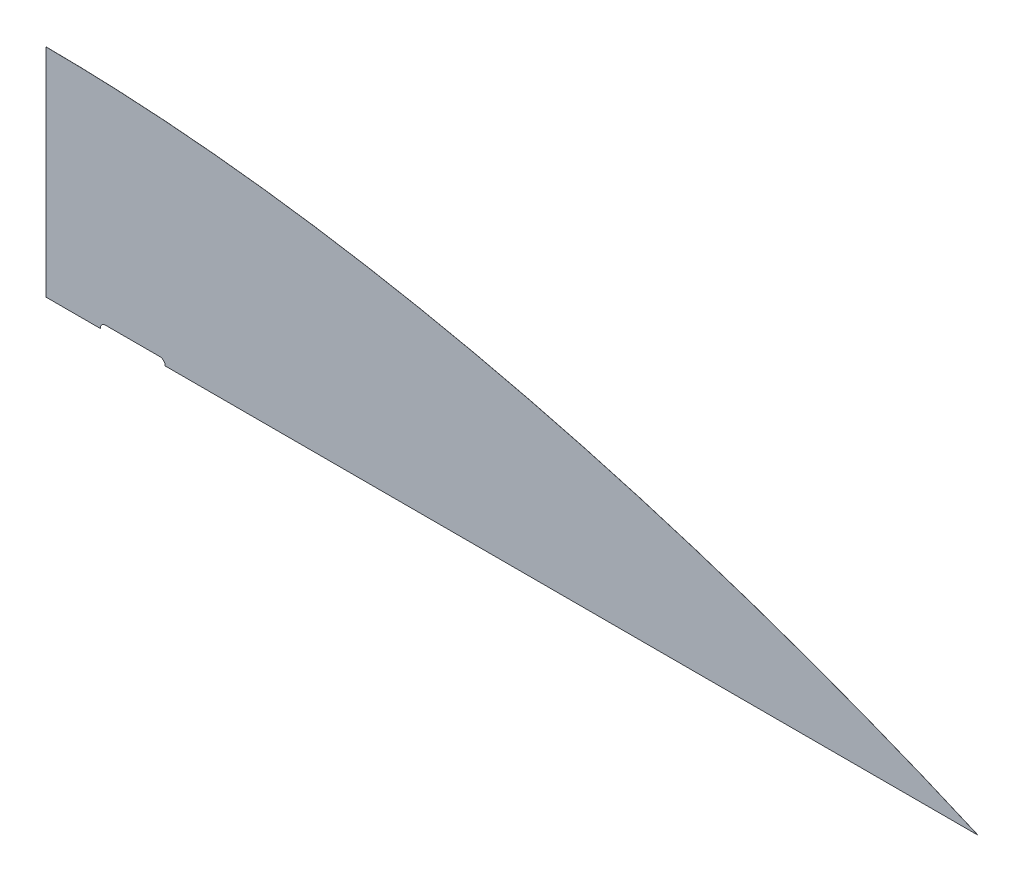
ISO-10303-21;
HEADER;
FILE_DESCRIPTION(('STEP AP214'),'2;1');
FILE_NAME('part.step','',(''),(''),'','','');
FILE_SCHEMA(('AUTOMOTIVE_DESIGN { 1 0 10303 214 1 1 1 1 }'));
ENDSEC;
DATA;
#1=APPLICATION_CONTEXT('core data for automotive mechanical design processes');
#2=APPLICATION_PROTOCOL_DEFINITION('international standard','automotive_design',2000,#1);
#3=PRODUCT_CONTEXT('',#1,'mechanical');
#4=PRODUCT('Part','Part','',(#3));
#5=PRODUCT_RELATED_PRODUCT_CATEGORY('part','',(#4));
#6=PRODUCT_DEFINITION_FORMATION('','',#4);
#7=PRODUCT_DEFINITION_CONTEXT('part definition',#1,'design');
#8=PRODUCT_DEFINITION('design','',#6,#7);
#9=PRODUCT_DEFINITION_SHAPE('','',#8);
#10=(LENGTH_UNIT() NAMED_UNIT(*) SI_UNIT(.MILLI.,.METRE.));
#11=(NAMED_UNIT(*) PLANE_ANGLE_UNIT() SI_UNIT($,.RADIAN.));
#12=(NAMED_UNIT(*) SI_UNIT($,.STERADIAN.) SOLID_ANGLE_UNIT());
#13=UNCERTAINTY_MEASURE_WITH_UNIT(LENGTH_MEASURE(1.E-05),#10,'distance_accuracy_value','');
#14=(GEOMETRIC_REPRESENTATION_CONTEXT(3) GLOBAL_UNCERTAINTY_ASSIGNED_CONTEXT((#13)) GLOBAL_UNIT_ASSIGNED_CONTEXT((#10,
#11,#12)) REPRESENTATION_CONTEXT('',''));
#15=CARTESIAN_POINT('',(0.,0.,0.));
#16=DIRECTION('',(0.,0.,1.));
#17=DIRECTION('',(1.,0.,0.));
#18=AXIS2_PLACEMENT_3D('',#15,#16,#17);
#19=CARTESIAN_POINT('',(0.,0.,0.126999999999999));
#20=DIRECTION('',(0.,1.,0.));
#21=DIRECTION('',(0.,0.,1.));
#22=AXIS2_PLACEMENT_3D('',#19,#20,#21);
#23=PLANE('',#22);
#24=DIRECTION('',(0.,0.,1.));
#25=VECTOR('',#24,1.);
#26=CARTESIAN_POINT('',(63.5,0.,0.));
#27=LINE('',#26,#25);
#28=CARTESIAN_POINT('',(63.4999999999999,0.,0.));
#29=VERTEX_POINT('',#28);
#30=CARTESIAN_POINT('',(63.4999999999999,0.,0.126999999999999));
#31=VERTEX_POINT('',#30);
#32=EDGE_CURVE('E126',#29,#31,#27,.T.);
#33=ORIENTED_EDGE('',*,*,#32,.T.);
#34=DIRECTION('',(1.,0.,0.));
#35=VECTOR('',#34,1.);
#36=CARTESIAN_POINT('',(0.,0.,0.126999999999999));
#37=LINE('',#36,#35);
#38=CARTESIAN_POINT('',(0.,0.,0.126999999999999));
#39=VERTEX_POINT('',#38);
#40=EDGE_CURVE('E144',#39,#31,#37,.T.);
#41=ORIENTED_EDGE('',*,*,#40,.F.);
#42=DIRECTION('',(0.,0.,-1.));
#43=VECTOR('',#42,1.);
#44=CARTESIAN_POINT('',(0.,0.,0.126999999999999));
#45=LINE('',#44,#43);
#46=CARTESIAN_POINT('',(0.,0.,0.));
#47=VERTEX_POINT('',#46);
#48=EDGE_CURVE('E43',#39,#47,#45,.T.);
#49=ORIENTED_EDGE('',*,*,#48,.T.);
#50=DIRECTION('',(1.,0.,0.));
#51=VECTOR('',#50,1.);
#52=CARTESIAN_POINT('',(0.,0.,0.));
#53=LINE('',#52,#51);
#54=EDGE_CURVE('E103',#47,#29,#53,.T.);
#55=ORIENTED_EDGE('',*,*,#54,.T.);
#56=EDGE_LOOP('',(#33,#41,#49,#55));
#57=FACE_BOUND('',#56,.T.);
#58=ADVANCED_FACE('F34',(#57),#23,.F.);
#59=DIRECTION('',(0.,0.,1.));
#60=VECTOR('',#59,1.);
#61=CARTESIAN_POINT('',(139.7,0.,0.));
#62=LINE('',#61,#60);
#63=CARTESIAN_POINT('',(139.7,0.,0.));
#64=VERTEX_POINT('',#63);
#65=CARTESIAN_POINT('',(139.7,0.,0.126999999999999));
#66=VERTEX_POINT('',#65);
#67=EDGE_CURVE('E108',#64,#66,#62,.T.);
#68=ORIENTED_EDGE('',*,*,#67,.F.);
#69=CARTESIAN_POINT('',(1092.2,0.,0.));
#70=VERTEX_POINT('',#69);
#71=EDGE_CURVE('E92',#64,#70,#53,.T.);
#72=ORIENTED_EDGE('',*,*,#71,.T.);
#73=DIRECTION('',(0.,0.,-1.));
#74=VECTOR('',#73,1.);
#75=CARTESIAN_POINT('',(1092.2,0.,0.126999999999999));
#76=LINE('',#75,#74);
#77=CARTESIAN_POINT('',(1092.2,0.,0.126999999999999));
#78=VERTEX_POINT('',#77);
#79=EDGE_CURVE('E146',#78,#70,#76,.T.);
#80=ORIENTED_EDGE('',*,*,#79,.F.);
#81=EDGE_CURVE('E110',#66,#78,#37,.T.);
#82=ORIENTED_EDGE('',*,*,#81,.F.);
#83=EDGE_LOOP('',(#68,#72,#80,#82));
#84=FACE_BOUND('',#83,.T.);
#85=ADVANCED_FACE('F109',(#84),#23,.F.);
#86=CARTESIAN_POINT('',(566.574596477157,179.041017308607,0.126999999999999));
#87=DIRECTION('',(0.,0.,1.));
#88=DIRECTION('',(1.,0.,0.));
#89=AXIS2_PLACEMENT_3D('',#86,#87,#88);
#90=PLANE('',#89);
#91=ORIENTED_EDGE('',*,*,#40,.T.);
#92=CARTESIAN_POINT('',(69.85,0.,0.126999999999999));
#93=DIRECTION('',(0.,0.,1.));
#94=DIRECTION('',(1.,0.,0.));
#95=AXIS2_PLACEMENT_3D('',#92,#93,#94);
#96=CIRCLE('',#95,6.35000000000008);
#97=CARTESIAN_POINT('',(69.85,6.35000000000016,0.126999999999999));
#98=VERTEX_POINT('',#97);
#99=EDGE_CURVE('E50',#31,#98,#96,.F.);
#100=ORIENTED_EDGE('',*,*,#99,.T.);
#101=DIRECTION('',(1.,0.,0.));
#102=VECTOR('',#101,1.);
#103=CARTESIAN_POINT('',(566.574596477157,6.35000000000027,0.126999999999999));
#104=LINE('',#103,#102);
#105=CARTESIAN_POINT('',(133.35,6.35000000000018,0.126999999999999));
#106=VERTEX_POINT('',#105);
#107=EDGE_CURVE('E54',#98,#106,#104,.T.);
#108=ORIENTED_EDGE('',*,*,#107,.T.);
#109=CARTESIAN_POINT('',(133.35,0.,0.126999999999999));
#110=DIRECTION('',(0.,0.,1.));
#111=DIRECTION('',(1.,0.,0.));
#112=AXIS2_PLACEMENT_3D('',#109,#110,#111);
#113=CIRCLE('',#112,6.35000000000017);
#114=EDGE_CURVE('E125',#106,#66,#113,.F.);
#115=ORIENTED_EDGE('',*,*,#114,.T.);
#116=ORIENTED_EDGE('',*,*,#81,.T.);
#117=CARTESIAN_POINT('',(1092.2,-3.05594159067454E-13,0.126999999999999));
#118=CARTESIAN_POINT('',(770.285770074945,140.499670678071,0.126999999999999));
#119=CARTESIAN_POINT('',(376.513153864139,252.276375478215,0.126999999999999));
#120=CARTESIAN_POINT('',(0.,254.,0.126999999999999));
#121=B_SPLINE_CURVE_WITH_KNOTS('',3,(#117,#118,#119,#120),.UNSPECIFIED.,.F.,.F.,(4,4),(0.,1.),.UNSPECIFIED.);
#122=CARTESIAN_POINT('',(0.,254.,0.126999999999999));
#123=VERTEX_POINT('',#122);
#124=EDGE_CURVE('E133',#78,#123,#121,.T.);
#125=ORIENTED_EDGE('',*,*,#124,.T.);
#126=DIRECTION('',(0.,-1.,0.));
#127=VECTOR('',#126,1.);
#128=CARTESIAN_POINT('',(0.,254.,0.126999999999999));
#129=LINE('',#128,#127);
#130=EDGE_CURVE('E139',#123,#39,#129,.T.);
#131=ORIENTED_EDGE('',*,*,#130,.T.);
#132=EDGE_LOOP('',(#91,#100,#108,#115,#116,#125,#131));
#133=FACE_BOUND('',#132,.T.);
#134=ADVANCED_FACE('F165',(#133),#90,.T.);
#135=CARTESIAN_POINT('',(566.574596477157,179.041017308607,0.));
#136=DIRECTION('',(0.,0.,1.));
#137=DIRECTION('',(1.,0.,0.));
#138=AXIS2_PLACEMENT_3D('',#135,#136,#137);
#139=PLANE('',#138);
#140=CARTESIAN_POINT('',(69.85,0.,0.));
#141=DIRECTION('',(0.,0.,-1.));
#142=DIRECTION('',(1.,0.,0.));
#143=AXIS2_PLACEMENT_3D('',#140,#141,#142);
#144=CIRCLE('',#143,6.35000000000008);
#145=CARTESIAN_POINT('',(69.85,6.35000000000016,0.));
#146=VERTEX_POINT('',#145);
#147=EDGE_CURVE('E123',#29,#146,#144,.T.);
#148=ORIENTED_EDGE('',*,*,#147,.F.);
#149=ORIENTED_EDGE('',*,*,#54,.F.);
#150=DIRECTION('',(0.,-1.,0.));
#151=VECTOR('',#150,1.);
#152=CARTESIAN_POINT('',(0.,254.,0.));
#153=LINE('',#152,#151);
#154=CARTESIAN_POINT('',(0.,254.,0.));
#155=VERTEX_POINT('',#154);
#156=EDGE_CURVE('E104',#155,#47,#153,.T.);
#157=ORIENTED_EDGE('',*,*,#156,.F.);
#158=CARTESIAN_POINT('',(1092.2,-3.05594159067454E-13,0.));
#159=CARTESIAN_POINT('',(770.285770074945,140.499670678071,0.));
#160=CARTESIAN_POINT('',(376.513153864139,252.276375478215,0.));
#161=CARTESIAN_POINT('',(0.,254.,0.));
#162=B_SPLINE_CURVE_WITH_KNOTS('',3,(#158,#159,#160,#161),.UNSPECIFIED.,.F.,.F.,(4,4),(0.,1.),.UNSPECIFIED.);
#163=EDGE_CURVE('E99',#70,#155,#162,.T.);
#164=ORIENTED_EDGE('',*,*,#163,.F.);
#165=ORIENTED_EDGE('',*,*,#71,.F.);
#166=CARTESIAN_POINT('',(133.35,0.,0.));
#167=DIRECTION('',(0.,0.,-1.));
#168=DIRECTION('',(-1.,0.,0.));
#169=AXIS2_PLACEMENT_3D('',#166,#167,#168);
#170=CIRCLE('',#169,6.35000000000017);
#171=CARTESIAN_POINT('',(133.35,6.35000000000018,0.));
#172=VERTEX_POINT('',#171);
#173=EDGE_CURVE('E96',#172,#64,#170,.T.);
#174=ORIENTED_EDGE('',*,*,#173,.F.);
#175=DIRECTION('',(1.,0.,0.));
#176=VECTOR('',#175,1.);
#177=CARTESIAN_POINT('',(69.85,6.35000000000017,0.));
#178=LINE('',#177,#176);
#179=EDGE_CURVE('E122',#146,#172,#178,.T.);
#180=ORIENTED_EDGE('',*,*,#179,.F.);
#181=EDGE_LOOP('',(#148,#149,#157,#164,#165,#174,#180));
#182=FACE_BOUND('',#181,.T.);
#183=ADVANCED_FACE('F94',(#182),#139,.F.);
#184=DIRECTION('',(0.,0.,-1.));
#185=VECTOR('',#184,1.);
#186=SURFACE_OF_LINEAR_EXTRUSION('',#121,#185);
#187=ORIENTED_EDGE('',*,*,#163,.T.);
#188=DIRECTION('',(0.,0.,-1.));
#189=VECTOR('',#188,1.);
#190=CARTESIAN_POINT('',(0.,254.,0.126999999999999));
#191=LINE('',#190,#189);
#192=EDGE_CURVE('E11',#123,#155,#191,.T.);
#193=ORIENTED_EDGE('',*,*,#192,.F.);
#194=ORIENTED_EDGE('',*,*,#124,.F.);
#195=ORIENTED_EDGE('',*,*,#79,.T.);
#196=EDGE_LOOP('',(#187,#193,#194,#195));
#197=FACE_BOUND('',#196,.T.);
#198=ADVANCED_FACE('F36',(#197),#186,.F.);
#199=CARTESIAN_POINT('',(0.,254.,0.126999999999999));
#200=DIRECTION('',(1.,0.,0.));
#201=DIRECTION('',(0.,1.,0.));
#202=AXIS2_PLACEMENT_3D('',#199,#200,#201);
#203=PLANE('',#202);
#204=ORIENTED_EDGE('',*,*,#156,.T.);
#205=ORIENTED_EDGE('',*,*,#48,.F.);
#206=ORIENTED_EDGE('',*,*,#130,.F.);
#207=ORIENTED_EDGE('',*,*,#192,.T.);
#208=EDGE_LOOP('',(#204,#205,#206,#207));
#209=FACE_BOUND('',#208,.T.);
#210=ADVANCED_FACE('F168',(#209),#203,.F.);
#211=CARTESIAN_POINT('',(69.85,0.,0.));
#212=DIRECTION('',(0.,0.,1.));
#213=DIRECTION('',(1.,0.,0.));
#214=AXIS2_PLACEMENT_3D('',#211,#212,#213);
#215=CYLINDRICAL_SURFACE('',#214,6.35000000000008);
#216=ORIENTED_EDGE('',*,*,#99,.F.);
#217=ORIENTED_EDGE('',*,*,#32,.F.);
#218=ORIENTED_EDGE('',*,*,#147,.T.);
#219=DIRECTION('',(0.,0.,1.));
#220=VECTOR('',#219,1.);
#221=CARTESIAN_POINT('',(69.85,6.35000000000008,0.));
#222=LINE('',#221,#220);
#223=EDGE_CURVE('E112',#146,#98,#222,.T.);
#224=ORIENTED_EDGE('',*,*,#223,.T.);
#225=EDGE_LOOP('',(#216,#217,#218,#224));
#226=FACE_BOUND('',#225,.T.);
#227=ADVANCED_FACE('F164',(#226),#215,.F.);
#228=CARTESIAN_POINT('',(69.85,6.35000000000017,0.));
#229=DIRECTION('',(0.,-1.,0.));
#230=DIRECTION('',(1.,0.,0.));
#231=AXIS2_PLACEMENT_3D('',#228,#229,#230);
#232=PLANE('',#231);
#233=ORIENTED_EDGE('',*,*,#107,.F.);
#234=ORIENTED_EDGE('',*,*,#223,.F.);
#235=ORIENTED_EDGE('',*,*,#179,.T.);
#236=DIRECTION('',(0.,0.,1.));
#237=VECTOR('',#236,1.);
#238=CARTESIAN_POINT('',(133.35,6.35000000000019,0.));
#239=LINE('',#238,#237);
#240=EDGE_CURVE('E116',#172,#106,#239,.T.);
#241=ORIENTED_EDGE('',*,*,#240,.T.);
#242=EDGE_LOOP('',(#233,#234,#235,#241));
#243=FACE_BOUND('',#242,.T.);
#244=ADVANCED_FACE('F186',(#243),#232,.T.);
#245=CARTESIAN_POINT('',(133.35,0.,0.));
#246=DIRECTION('',(0.,0.,1.));
#247=DIRECTION('',(1.,0.,0.));
#248=AXIS2_PLACEMENT_3D('',#245,#246,#247);
#249=CYLINDRICAL_SURFACE('',#248,6.35000000000017);
#250=ORIENTED_EDGE('',*,*,#114,.F.);
#251=ORIENTED_EDGE('',*,*,#240,.F.);
#252=ORIENTED_EDGE('',*,*,#173,.T.);
#253=ORIENTED_EDGE('',*,*,#67,.T.);
#254=EDGE_LOOP('',(#250,#251,#252,#253));
#255=FACE_BOUND('',#254,.T.);
#256=ADVANCED_FACE('F114',(#255),#249,.F.);
#257=CLOSED_SHELL('',(#58,#85,#134,#183,#198,#210,#227,#244,#256));
#258=MANIFOLD_SOLID_BREP('B2',#257);
#259=ADVANCED_BREP_SHAPE_REPRESENTATION('',(#18,#258),#14);
#260=SHAPE_DEFINITION_REPRESENTATION(#9,#259);
ENDSEC;
END-ISO-10303-21;
